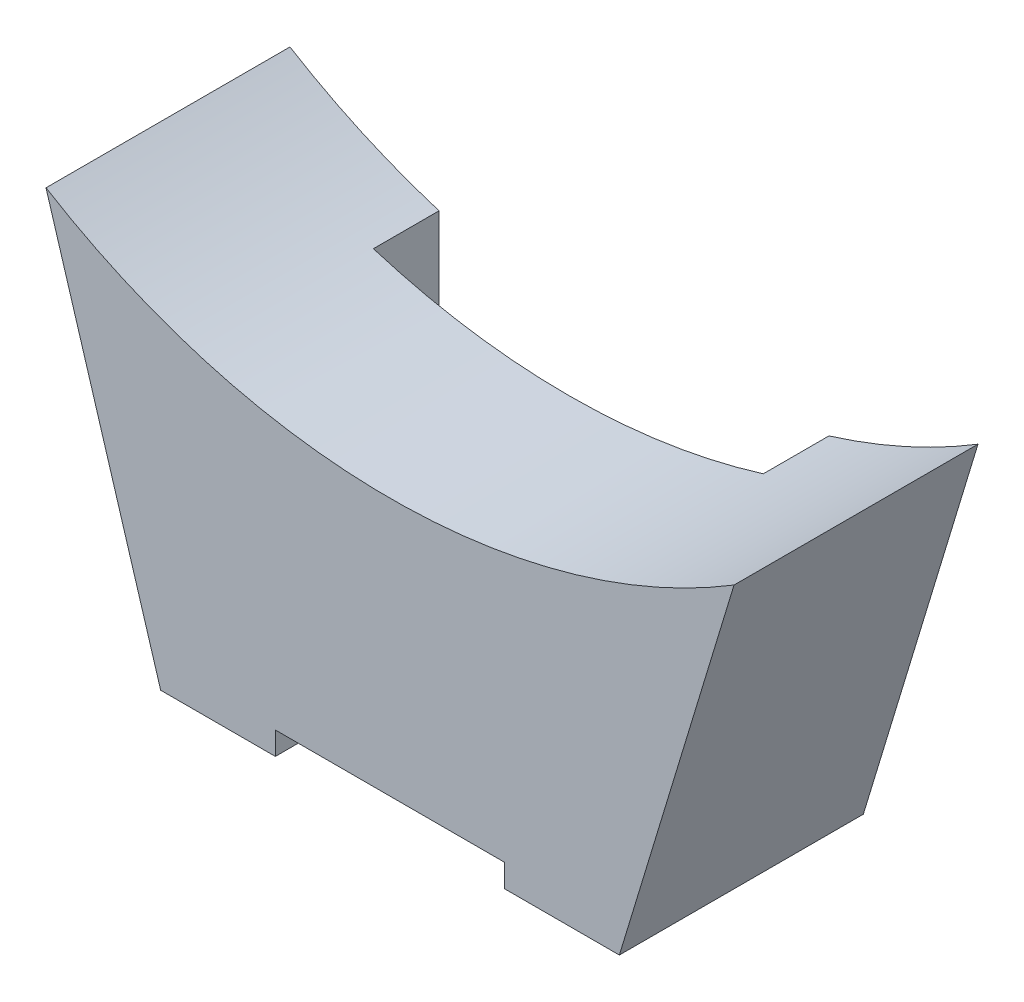
ISO-10303-21;
HEADER;
FILE_DESCRIPTION(('STEP AP214'),'2;1');
FILE_NAME('part.step','',(''),(''),'','','');
FILE_SCHEMA(('AUTOMOTIVE_DESIGN { 1 0 10303 214 1 1 1 1 }'));
ENDSEC;
DATA;
#1=APPLICATION_CONTEXT('core data for automotive mechanical design processes');
#2=APPLICATION_PROTOCOL_DEFINITION('international standard','automotive_design',2000,#1);
#3=PRODUCT_CONTEXT('',#1,'mechanical');
#4=PRODUCT('Part','Part','',(#3));
#5=PRODUCT_RELATED_PRODUCT_CATEGORY('part','',(#4));
#6=PRODUCT_DEFINITION_FORMATION('','',#4);
#7=PRODUCT_DEFINITION_CONTEXT('part definition',#1,'design');
#8=PRODUCT_DEFINITION('design','',#6,#7);
#9=PRODUCT_DEFINITION_SHAPE('','',#8);
#10=(LENGTH_UNIT() NAMED_UNIT(*) SI_UNIT(.MILLI.,.METRE.));
#11=(NAMED_UNIT(*) PLANE_ANGLE_UNIT() SI_UNIT($,.RADIAN.));
#12=(NAMED_UNIT(*) SI_UNIT($,.STERADIAN.) SOLID_ANGLE_UNIT());
#13=UNCERTAINTY_MEASURE_WITH_UNIT(LENGTH_MEASURE(1.E-05),#10,'distance_accuracy_value','');
#14=(GEOMETRIC_REPRESENTATION_CONTEXT(3) GLOBAL_UNCERTAINTY_ASSIGNED_CONTEXT((#13)) GLOBAL_UNIT_ASSIGNED_CONTEXT((#10,
#11,#12)) REPRESENTATION_CONTEXT('',''));
#15=CARTESIAN_POINT('',(0.,0.,0.));
#16=DIRECTION('',(0.,0.,1.));
#17=DIRECTION('',(1.,0.,0.));
#18=AXIS2_PLACEMENT_3D('',#15,#16,#17);
#19=CARTESIAN_POINT('',(0.,0.,0.));
#20=DIRECTION('',(0.,0.,-1.));
#21=DIRECTION('',(-1.,0.,0.));
#22=AXIS2_PLACEMENT_3D('',#19,#20,#21);
#23=PLANE('',#22);
#24=DIRECTION('',(0.,-1.,0.));
#25=VECTOR('',#24,1.);
#26=CARTESIAN_POINT('',(17.,-60.,0.));
#27=LINE('',#26,#25);
#28=CARTESIAN_POINT('',(17.,-54.9295002708017,0.));
#29=VERTEX_POINT('',#28);
#30=CARTESIAN_POINT('',(17.,-71.5,0.));
#31=VERTEX_POINT('',#30);
#32=EDGE_CURVE('E377',#29,#31,#27,.T.);
#33=ORIENTED_EDGE('',*,*,#32,.F.);
#34=CARTESIAN_POINT('',(0.,0.,0.));
#35=DIRECTION('',(0.,0.,-1.));
#36=DIRECTION('',(-1.,0.,0.));
#37=AXIS2_PLACEMENT_3D('',#34,#35,#36);
#38=CIRCLE('',#37,57.5);
#39=CARTESIAN_POINT('',(30.,-49.0535421758715,0.));
#40=VERTEX_POINT('',#39);
#41=EDGE_CURVE('E400',#40,#29,#38,.T.);
#42=ORIENTED_EDGE('',*,*,#41,.F.);
#43=DIRECTION('',(0.290438967331062,0.956893518765629,0.));
#44=VECTOR('',#43,1.);
#45=CARTESIAN_POINT('',(20.,-82.,0.));
#46=LINE('',#45,#44);
#47=CARTESIAN_POINT('',(20.,-82.,0.));
#48=VERTEX_POINT('',#47);
#49=EDGE_CURVE('E414',#48,#40,#46,.T.);
#50=ORIENTED_EDGE('',*,*,#49,.F.);
#51=DIRECTION('',(1.,0.,0.));
#52=VECTOR('',#51,1.);
#53=CARTESIAN_POINT('',(18.,-82.,0.));
#54=LINE('',#53,#52);
#55=CARTESIAN_POINT('',(18.,-82.,0.));
#56=VERTEX_POINT('',#55);
#57=EDGE_CURVE('E409',#56,#48,#54,.T.);
#58=ORIENTED_EDGE('',*,*,#57,.F.);
#59=DIRECTION('',(0.,-1.,0.));
#60=VECTOR('',#59,1.);
#61=CARTESIAN_POINT('',(18.,-60.,0.));
#62=LINE('',#61,#60);
#63=CARTESIAN_POINT('',(18.,-80.,0.));
#64=VERTEX_POINT('',#63);
#65=EDGE_CURVE('E410',#64,#56,#62,.T.);
#66=ORIENTED_EDGE('',*,*,#65,.F.);
#67=DIRECTION('',(1.,0.,0.));
#68=VECTOR('',#67,1.);
#69=CARTESIAN_POINT('',(15.6,-80.,0.));
#70=LINE('',#69,#68);
#71=CARTESIAN_POINT('',(15.6,-80.,0.));
#72=VERTEX_POINT('',#71);
#73=EDGE_CURVE('E285',#72,#64,#70,.T.);
#74=ORIENTED_EDGE('',*,*,#73,.F.);
#75=DIRECTION('',(0.,-1.,0.));
#76=VECTOR('',#75,1.);
#77=CARTESIAN_POINT('',(15.6,-76.5,0.));
#78=LINE('',#77,#76);
#79=CARTESIAN_POINT('',(15.6,-71.5,0.));
#80=VERTEX_POINT('',#79);
#81=EDGE_CURVE('E287',#80,#72,#78,.T.);
#82=ORIENTED_EDGE('',*,*,#81,.F.);
#83=DIRECTION('',(1.,0.,0.));
#84=VECTOR('',#83,1.);
#85=CARTESIAN_POINT('',(-17.,-71.5,0.));
#86=LINE('',#85,#84);
#87=EDGE_CURVE('E389',#80,#31,#86,.T.);
#88=ORIENTED_EDGE('',*,*,#87,.T.);
#89=EDGE_LOOP('',(#33,#42,#50,#58,#66,#74,#82,#88));
#90=FACE_BOUND('',#89,.T.);
#91=ADVANCED_FACE('F32',(#90),#23,.T.);
#92=CARTESIAN_POINT('',(8.8,-76.5,62.9963595499958));
#93=DIRECTION('',(0.,1.,0.));
#94=DIRECTION('',(0.,0.,1.));
#95=AXIS2_PLACEMENT_3D('',#92,#93,#94);
#96=PLANE('',#95);
#97=DIRECTION('',(1.,0.,0.));
#98=VECTOR('',#97,1.);
#99=CARTESIAN_POINT('',(-15.6,-76.5,7.77499999999998));
#100=LINE('',#99,#98);
#101=CARTESIAN_POINT('',(8.8,-76.5,7.77499999999998));
#102=VERTEX_POINT('',#101);
#103=CARTESIAN_POINT('',(15.6,-76.5,7.77499999999998));
#104=VERTEX_POINT('',#103);
#105=EDGE_CURVE('E372',#102,#104,#100,.T.);
#106=ORIENTED_EDGE('',*,*,#105,.T.);
#107=DIRECTION('',(0.,0.,-1.));
#108=VECTOR('',#107,1.);
#109=CARTESIAN_POINT('',(15.6,-76.5,62.9963595499958));
#110=LINE('',#109,#108);
#111=CARTESIAN_POINT('',(15.6,-76.5,18.275));
#112=VERTEX_POINT('',#111);
#113=EDGE_CURVE('E272',#112,#104,#110,.T.);
#114=ORIENTED_EDGE('',*,*,#113,.F.);
#115=DIRECTION('',(-1.,0.,0.));
#116=VECTOR('',#115,1.);
#117=CARTESIAN_POINT('',(8.8,-76.5,18.275));
#118=LINE('',#117,#116);
#119=CARTESIAN_POINT('',(8.8,-76.5,18.275));
#120=VERTEX_POINT('',#119);
#121=EDGE_CURVE('E309',#112,#120,#118,.T.);
#122=ORIENTED_EDGE('',*,*,#121,.T.);
#123=DIRECTION('',(0.,0.,-1.));
#124=VECTOR('',#123,1.);
#125=CARTESIAN_POINT('',(8.8,-76.5,62.9963595499958));
#126=LINE('',#125,#124);
#127=EDGE_CURVE('E269',#120,#102,#126,.T.);
#128=ORIENTED_EDGE('',*,*,#127,.T.);
#129=EDGE_LOOP('',(#106,#114,#122,#128));
#130=FACE_BOUND('',#129,.T.);
#131=ADVANCED_FACE('F536',(#130),#96,.F.);
#132=CARTESIAN_POINT('',(8.79999999999999,-71.5,62.9963595499958));
#133=DIRECTION('',(1.,0.,0.));
#134=DIRECTION('',(0.,1.,0.));
#135=AXIS2_PLACEMENT_3D('',#132,#133,#134);
#136=PLANE('',#135);
#137=DIRECTION('',(0.,1.,0.));
#138=VECTOR('',#137,1.);
#139=CARTESIAN_POINT('',(8.79999999999999,-71.5,7.77499999999998));
#140=LINE('',#139,#138);
#141=CARTESIAN_POINT('',(8.79999999999999,-71.5,7.77499999999998));
#142=VERTEX_POINT('',#141);
#143=EDGE_CURVE('E350',#102,#142,#140,.T.);
#144=ORIENTED_EDGE('',*,*,#143,.F.);
#145=ORIENTED_EDGE('',*,*,#127,.F.);
#146=DIRECTION('',(0.,1.,0.));
#147=VECTOR('',#146,1.);
#148=CARTESIAN_POINT('',(8.79999999999999,-71.5,18.275));
#149=LINE('',#148,#147);
#150=CARTESIAN_POINT('',(8.79999999999999,-71.5,18.275));
#151=VERTEX_POINT('',#150);
#152=EDGE_CURVE('E306',#120,#151,#149,.T.);
#153=ORIENTED_EDGE('',*,*,#152,.T.);
#154=DIRECTION('',(0.,0.,-1.));
#155=VECTOR('',#154,1.);
#156=CARTESIAN_POINT('',(8.79999999999999,-71.5,62.9963595499958));
#157=LINE('',#156,#155);
#158=EDGE_CURVE('E266',#151,#142,#157,.T.);
#159=ORIENTED_EDGE('',*,*,#158,.T.);
#160=EDGE_LOOP('',(#144,#145,#153,#159));
#161=FACE_BOUND('',#160,.T.);
#162=ADVANCED_FACE('F539',(#161),#136,.F.);
#163=CARTESIAN_POINT('',(-8.79999999999999,-71.5,62.9963595499958));
#164=DIRECTION('',(-1.,0.,0.));
#165=DIRECTION('',(0.,-1.,0.));
#166=AXIS2_PLACEMENT_3D('',#163,#164,#165);
#167=PLANE('',#166);
#168=DIRECTION('',(0.,-1.,0.));
#169=VECTOR('',#168,1.);
#170=CARTESIAN_POINT('',(-8.79999999999999,-71.5,7.77499999999998));
#171=LINE('',#170,#169);
#172=CARTESIAN_POINT('',(-8.79999999999999,-71.5,7.77499999999998));
#173=VERTEX_POINT('',#172);
#174=CARTESIAN_POINT('',(-8.79999999999999,-76.5,7.77499999999998));
#175=VERTEX_POINT('',#174);
#176=EDGE_CURVE('E352',#173,#175,#171,.T.);
#177=ORIENTED_EDGE('',*,*,#176,.F.);
#178=DIRECTION('',(0.,0.,-1.));
#179=VECTOR('',#178,1.);
#180=CARTESIAN_POINT('',(-8.79999999999999,-71.5,62.9963595499958));
#181=LINE('',#180,#179);
#182=CARTESIAN_POINT('',(-8.79999999999999,-71.5,18.275));
#183=VERTEX_POINT('',#182);
#184=EDGE_CURVE('E263',#183,#173,#181,.T.);
#185=ORIENTED_EDGE('',*,*,#184,.F.);
#186=DIRECTION('',(0.,-1.,0.));
#187=VECTOR('',#186,1.);
#188=CARTESIAN_POINT('',(-8.79999999999999,-71.5,18.275));
#189=LINE('',#188,#187);
#190=CARTESIAN_POINT('',(-8.79999999999999,-76.5,18.275));
#191=VERTEX_POINT('',#190);
#192=EDGE_CURVE('E300',#183,#191,#189,.T.);
#193=ORIENTED_EDGE('',*,*,#192,.T.);
#194=DIRECTION('',(0.,0.,-1.));
#195=VECTOR('',#194,1.);
#196=CARTESIAN_POINT('',(-8.79999999999999,-76.5,62.9963595499958));
#197=LINE('',#196,#195);
#198=EDGE_CURVE('E260',#191,#175,#197,.T.);
#199=ORIENTED_EDGE('',*,*,#198,.T.);
#200=EDGE_LOOP('',(#177,#185,#193,#199));
#201=FACE_BOUND('',#200,.T.);
#202=ADVANCED_FACE('F545',(#201),#167,.F.);
#203=CARTESIAN_POINT('',(-8.79999999999999,-76.5,62.9963595499958));
#204=DIRECTION('',(0.,1.,0.));
#205=DIRECTION('',(0.,0.,1.));
#206=AXIS2_PLACEMENT_3D('',#203,#204,#205);
#207=PLANE('',#206);
#208=CARTESIAN_POINT('',(-15.6,-76.5,7.77499999999998));
#209=VERTEX_POINT('',#208);
#210=EDGE_CURVE('E369',#209,#175,#100,.T.);
#211=ORIENTED_EDGE('',*,*,#210,.T.);
#212=ORIENTED_EDGE('',*,*,#198,.F.);
#213=DIRECTION('',(-1.,0.,0.));
#214=VECTOR('',#213,1.);
#215=CARTESIAN_POINT('',(-8.79999999999999,-76.5,18.275));
#216=LINE('',#215,#214);
#217=CARTESIAN_POINT('',(-15.6,-76.5,18.275));
#218=VERTEX_POINT('',#217);
#219=EDGE_CURVE('E297',#191,#218,#216,.T.);
#220=ORIENTED_EDGE('',*,*,#219,.T.);
#221=DIRECTION('',(0.,0.,-1.));
#222=VECTOR('',#221,1.);
#223=CARTESIAN_POINT('',(-15.6,-76.5,62.9963595499958));
#224=LINE('',#223,#222);
#225=EDGE_CURVE('E256',#218,#209,#224,.T.);
#226=ORIENTED_EDGE('',*,*,#225,.T.);
#227=EDGE_LOOP('',(#211,#212,#220,#226));
#228=FACE_BOUND('',#227,.T.);
#229=ADVANCED_FACE('F550',(#228),#207,.F.);
#230=CARTESIAN_POINT('',(-20.,-82.,21.275));
#231=DIRECTION('',(0.,1.,0.));
#232=DIRECTION('',(0.,0.,1.));
#233=AXIS2_PLACEMENT_3D('',#230,#231,#232);
#234=PLANE('',#233);
#235=DIRECTION('',(0.,0.,1.));
#236=VECTOR('',#235,1.);
#237=CARTESIAN_POINT('',(-10.,-82.,0.));
#238=LINE('',#237,#236);
#239=CARTESIAN_POINT('',(-10.,-82.,16.275));
#240=VERTEX_POINT('',#239);
#241=CARTESIAN_POINT('',(-10.,-82.,21.275));
#242=VERTEX_POINT('',#241);
#243=EDGE_CURVE('E331',#240,#242,#238,.T.);
#244=ORIENTED_EDGE('',*,*,#243,.T.);
#245=DIRECTION('',(1.,0.,0.));
#246=VECTOR('',#245,1.);
#247=CARTESIAN_POINT('',(-20.,-82.,21.275));
#248=LINE('',#247,#246);
#249=CARTESIAN_POINT('',(-20.,-82.,21.275));
#250=VERTEX_POINT('',#249);
#251=EDGE_CURVE('E317',#250,#242,#248,.T.);
#252=ORIENTED_EDGE('',*,*,#251,.F.);
#253=DIRECTION('',(0.,0.,-1.));
#254=VECTOR('',#253,1.);
#255=CARTESIAN_POINT('',(-20.,-82.,21.275));
#256=LINE('',#255,#254);
#257=CARTESIAN_POINT('',(-20.,-82.,0.));
#258=VERTEX_POINT('',#257);
#259=EDGE_CURVE('E293',#250,#258,#256,.T.);
#260=ORIENTED_EDGE('',*,*,#259,.T.);
#261=DIRECTION('',(1.,0.,0.));
#262=VECTOR('',#261,1.);
#263=CARTESIAN_POINT('',(-18.,-82.,0.));
#264=LINE('',#263,#262);
#265=CARTESIAN_POINT('',(-18.,-82.,0.));
#266=VERTEX_POINT('',#265);
#267=EDGE_CURVE('E405',#258,#266,#264,.T.);
#268=ORIENTED_EDGE('',*,*,#267,.T.);
#269=DIRECTION('',(0.,0.,1.));
#270=VECTOR('',#269,1.);
#271=CARTESIAN_POINT('',(-18.,-82.,-68.4504863617278));
#272=LINE('',#271,#270);
#273=CARTESIAN_POINT('',(-18.,-82.,16.275));
#274=VERTEX_POINT('',#273);
#275=EDGE_CURVE('E401',#266,#274,#272,.T.);
#276=ORIENTED_EDGE('',*,*,#275,.T.);
#277=DIRECTION('',(-1.,0.,0.));
#278=VECTOR('',#277,1.);
#279=CARTESIAN_POINT('',(-20.,-82.,16.275));
#280=LINE('',#279,#278);
#281=EDGE_CURVE('E55',#240,#274,#280,.T.);
#282=ORIENTED_EDGE('',*,*,#281,.F.);
#283=EDGE_LOOP('',(#244,#252,#260,#268,#276,#282));
#284=FACE_BOUND('',#283,.T.);
#285=ADVANCED_FACE('F459',(#284),#234,.F.);
#286=CARTESIAN_POINT('',(-20.,-80.,16.275));
#287=DIRECTION('',(0.,-1.,0.));
#288=DIRECTION('',(0.,0.,-1.));
#289=AXIS2_PLACEMENT_3D('',#286,#287,#288);
#290=PLANE('',#289);
#291=DIRECTION('',(1.,0.,0.));
#292=VECTOR('',#291,1.);
#293=CARTESIAN_POINT('',(0.,-80.,18.275));
#294=LINE('',#293,#292);
#295=CARTESIAN_POINT('',(-15.6,-80.,18.275));
#296=VERTEX_POINT('',#295);
#297=CARTESIAN_POINT('',(-10.,-80.,18.275));
#298=VERTEX_POINT('',#297);
#299=EDGE_CURVE('E252',#296,#298,#294,.T.);
#300=ORIENTED_EDGE('',*,*,#299,.T.);
#301=DIRECTION('',(0.,0.,1.));
#302=VECTOR('',#301,1.);
#303=CARTESIAN_POINT('',(-10.,-80.,0.));
#304=LINE('',#303,#302);
#305=CARTESIAN_POINT('',(-10.,-80.,16.275));
#306=VERTEX_POINT('',#305);
#307=EDGE_CURVE('E330',#306,#298,#304,.T.);
#308=ORIENTED_EDGE('',*,*,#307,.F.);
#309=DIRECTION('',(1.,0.,0.));
#310=VECTOR('',#309,1.);
#311=CARTESIAN_POINT('',(-20.,-80.,16.275));
#312=LINE('',#311,#310);
#313=CARTESIAN_POINT('',(-15.6,-80.,16.275));
#314=VERTEX_POINT('',#313);
#315=EDGE_CURVE('E324',#314,#306,#312,.T.);
#316=ORIENTED_EDGE('',*,*,#315,.F.);
#317=DIRECTION('',(0.,0.,-1.));
#318=VECTOR('',#317,1.);
#319=CARTESIAN_POINT('',(-15.6,-80.,62.9963595499958));
#320=LINE('',#319,#318);
#321=EDGE_CURVE('E279',#296,#314,#320,.T.);
#322=ORIENTED_EDGE('',*,*,#321,.F.);
#323=EDGE_LOOP('',(#300,#308,#316,#322));
#324=FACE_BOUND('',#323,.T.);
#325=ADVANCED_FACE('F479',(#324),#290,.F.);
#326=CARTESIAN_POINT('',(0.,0.,16.275));
#327=DIRECTION('',(0.,0.,1.));
#328=DIRECTION('',(1.,0.,0.));
#329=AXIS2_PLACEMENT_3D('',#326,#327,#328);
#330=PLANE('',#329);
#331=ORIENTED_EDGE('',*,*,#281,.T.);
#332=DIRECTION('',(0.,1.,0.));
#333=VECTOR('',#332,1.);
#334=CARTESIAN_POINT('',(-18.,0.,16.275));
#335=LINE('',#334,#333);
#336=CARTESIAN_POINT('',(-18.,-80.,16.275));
#337=VERTEX_POINT('',#336);
#338=EDGE_CURVE('E392',#274,#337,#335,.T.);
#339=ORIENTED_EDGE('',*,*,#338,.T.);
#340=EDGE_CURVE('E322',#337,#314,#312,.T.);
#341=ORIENTED_EDGE('',*,*,#340,.T.);
#342=ORIENTED_EDGE('',*,*,#315,.T.);
#343=DIRECTION('',(0.,-1.,0.));
#344=VECTOR('',#343,1.);
#345=CARTESIAN_POINT('',(-10.,0.,16.275));
#346=LINE('',#345,#344);
#347=EDGE_CURVE('E247',#306,#240,#346,.T.);
#348=ORIENTED_EDGE('',*,*,#347,.T.);
#349=EDGE_LOOP('',(#331,#339,#341,#342,#348));
#350=FACE_BOUND('',#349,.T.);
#351=ADVANCED_FACE('F466',(#350),#330,.F.);
#352=CARTESIAN_POINT('',(-15.6,-80.,62.9963595499958));
#353=DIRECTION('',(0.,1.,0.));
#354=DIRECTION('',(0.,0.,1.));
#355=AXIS2_PLACEMENT_3D('',#352,#353,#354);
#356=PLANE('',#355);
#357=ORIENTED_EDGE('',*,*,#340,.F.);
#358=DIRECTION('',(0.,0.,-1.));
#359=VECTOR('',#358,1.);
#360=CARTESIAN_POINT('',(-18.,-80.,62.9963595499958));
#361=LINE('',#360,#359);
#362=CARTESIAN_POINT('',(-18.,-80.,0.));
#363=VERTEX_POINT('',#362);
#364=EDGE_CURVE('E394',#337,#363,#361,.T.);
#365=ORIENTED_EDGE('',*,*,#364,.T.);
#366=DIRECTION('',(1.,0.,0.));
#367=VECTOR('',#366,1.);
#368=CARTESIAN_POINT('',(-15.6,-80.,0.));
#369=LINE('',#368,#367);
#370=CARTESIAN_POINT('',(-15.6,-80.,0.));
#371=VERTEX_POINT('',#370);
#372=EDGE_CURVE('E283',#363,#371,#369,.T.);
#373=ORIENTED_EDGE('',*,*,#372,.T.);
#374=EDGE_CURVE('E282',#314,#371,#320,.T.);
#375=ORIENTED_EDGE('',*,*,#374,.F.);
#376=EDGE_LOOP('',(#357,#365,#373,#375));
#377=FACE_BOUND('',#376,.T.);
#378=ADVANCED_FACE('F471',(#377),#356,.F.);
#379=CARTESIAN_POINT('',(15.6,-80.,62.9963595499958));
#380=DIRECTION('',(0.,1.,0.));
#381=DIRECTION('',(0.,0.,1.));
#382=AXIS2_PLACEMENT_3D('',#379,#380,#381);
#383=PLANE('',#382);
#384=ORIENTED_EDGE('',*,*,#73,.T.);
#385=DIRECTION('',(0.,0.,1.));
#386=VECTOR('',#385,1.);
#387=CARTESIAN_POINT('',(18.,-80.,62.9963595499958));
#388=LINE('',#387,#386);
#389=CARTESIAN_POINT('',(18.,-80.,16.275));
#390=VERTEX_POINT('',#389);
#391=EDGE_CURVE('E396',#64,#390,#388,.T.);
#392=ORIENTED_EDGE('',*,*,#391,.T.);
#393=CARTESIAN_POINT('',(15.6,-80.,16.275));
#394=VERTEX_POINT('',#393);
#395=EDGE_CURVE('E329',#394,#390,#312,.T.);
#396=ORIENTED_EDGE('',*,*,#395,.F.);
#397=DIRECTION('',(0.,0.,-1.));
#398=VECTOR('',#397,1.);
#399=CARTESIAN_POINT('',(15.6,-80.,62.9963595499958));
#400=LINE('',#399,#398);
#401=EDGE_CURVE('E278',#394,#72,#400,.T.);
#402=ORIENTED_EDGE('',*,*,#401,.T.);
#403=EDGE_LOOP('',(#384,#392,#396,#402));
#404=FACE_BOUND('',#403,.T.);
#405=ADVANCED_FACE('F563',(#404),#383,.F.);
#406=CARTESIAN_POINT('',(0.,0.,18.275));
#407=DIRECTION('',(0.,0.,1.));
#408=DIRECTION('',(1.,0.,0.));
#409=AXIS2_PLACEMENT_3D('',#406,#407,#408);
#410=PLANE('',#409);
#411=ORIENTED_EDGE('',*,*,#299,.F.);
#412=DIRECTION('',(0.,-1.,0.));
#413=VECTOR('',#412,1.);
#414=CARTESIAN_POINT('',(-15.6,-76.5,18.275));
#415=LINE('',#414,#413);
#416=EDGE_CURVE('E294',#218,#296,#415,.T.);
#417=ORIENTED_EDGE('',*,*,#416,.F.);
#418=ORIENTED_EDGE('',*,*,#219,.F.);
#419=ORIENTED_EDGE('',*,*,#192,.F.);
#420=DIRECTION('',(-1.,0.,0.));
#421=VECTOR('',#420,1.);
#422=CARTESIAN_POINT('',(8.79999999999999,-71.5,18.275));
#423=LINE('',#422,#421);
#424=EDGE_CURVE('E303',#151,#183,#423,.T.);
#425=ORIENTED_EDGE('',*,*,#424,.F.);
#426=ORIENTED_EDGE('',*,*,#152,.F.);
#427=ORIENTED_EDGE('',*,*,#121,.F.);
#428=DIRECTION('',(0.,1.,0.));
#429=VECTOR('',#428,1.);
#430=CARTESIAN_POINT('',(15.6,-76.5,18.275));
#431=LINE('',#430,#429);
#432=CARTESIAN_POINT('',(15.6,-80.,18.275));
#433=VERTEX_POINT('',#432);
#434=EDGE_CURVE('E259',#433,#112,#431,.T.);
#435=ORIENTED_EDGE('',*,*,#434,.F.);
#436=CARTESIAN_POINT('',(10.,-80.,18.275));
#437=VERTEX_POINT('',#436);
#438=EDGE_CURVE('E255',#437,#433,#294,.T.);
#439=ORIENTED_EDGE('',*,*,#438,.F.);
#440=DIRECTION('',(-1.,0.,0.));
#441=VECTOR('',#440,1.);
#442=CARTESIAN_POINT('',(0.,-80.,18.275));
#443=LINE('',#442,#441);
#444=EDGE_CURVE('E326',#437,#298,#443,.T.);
#445=ORIENTED_EDGE('',*,*,#444,.T.);
#446=EDGE_LOOP('',(#411,#417,#418,#419,#425,#426,#427,#435,#439,#445));
#447=FACE_BOUND('',#446,.T.);
#448=ADVANCED_FACE('F482',(#447),#410,.F.);
#449=CARTESIAN_POINT('',(-17.,-54.9295002708017,0.));
#450=VERTEX_POINT('',#449);
#451=CARTESIAN_POINT('',(-30.,-49.0535421758715,0.));
#452=VERTEX_POINT('',#451);
#453=EDGE_CURVE('E413',#450,#452,#38,.T.);
#454=ORIENTED_EDGE('',*,*,#453,.F.);
#455=DIRECTION('',(0.,-1.,0.));
#456=VECTOR('',#455,1.);
#457=CARTESIAN_POINT('',(-17.,-60.,0.));
#458=LINE('',#457,#456);
#459=CARTESIAN_POINT('',(-17.,-71.5,0.));
#460=VERTEX_POINT('',#459);
#461=EDGE_CURVE('E47',#450,#460,#458,.T.);
#462=ORIENTED_EDGE('',*,*,#461,.T.);
#463=CARTESIAN_POINT('',(-15.6,-71.5,0.));
#464=VERTEX_POINT('',#463);
#465=EDGE_CURVE('E386',#460,#464,#86,.T.);
#466=ORIENTED_EDGE('',*,*,#465,.T.);
#467=DIRECTION('',(0.,1.,0.));
#468=VECTOR('',#467,1.);
#469=CARTESIAN_POINT('',(-15.6,-76.5,0.));
#470=LINE('',#469,#468);
#471=EDGE_CURVE('E290',#371,#464,#470,.T.);
#472=ORIENTED_EDGE('',*,*,#471,.F.);
#473=ORIENTED_EDGE('',*,*,#372,.F.);
#474=DIRECTION('',(0.,1.,0.));
#475=VECTOR('',#474,1.);
#476=CARTESIAN_POINT('',(-18.,-60.,0.));
#477=LINE('',#476,#475);
#478=EDGE_CURVE('E404',#266,#363,#477,.T.);
#479=ORIENTED_EDGE('',*,*,#478,.F.);
#480=ORIENTED_EDGE('',*,*,#267,.F.);
#481=DIRECTION('',(0.290438967331062,-0.956893518765628,0.));
#482=VECTOR('',#481,1.);
#483=CARTESIAN_POINT('',(-30.,-49.0535421758715,0.));
#484=LINE('',#483,#482);
#485=EDGE_CURVE('E417',#452,#258,#484,.T.);
#486=ORIENTED_EDGE('',*,*,#485,.F.);
#487=EDGE_LOOP('',(#454,#462,#466,#472,#473,#479,#480,#486));
#488=FACE_BOUND('',#487,.T.);
#489=ADVANCED_FACE('F555',(#488),#23,.T.);
#490=CARTESIAN_POINT('',(15.6,-76.5,62.9963595499958));
#491=DIRECTION('',(1.,0.,0.));
#492=DIRECTION('',(0.,0.,-1.));
#493=AXIS2_PLACEMENT_3D('',#490,#491,#492);
#494=PLANE('',#493);
#495=EDGE_CURVE('E275',#433,#394,#400,.T.);
#496=ORIENTED_EDGE('',*,*,#495,.F.);
#497=ORIENTED_EDGE('',*,*,#434,.T.);
#498=ORIENTED_EDGE('',*,*,#113,.T.);
#499=DIRECTION('',(0.,1.,0.));
#500=VECTOR('',#499,1.);
#501=CARTESIAN_POINT('',(15.6,-76.5,7.77499999999998));
#502=LINE('',#501,#500);
#503=CARTESIAN_POINT('',(15.6,-71.5,7.77499999999998));
#504=VERTEX_POINT('',#503);
#505=EDGE_CURVE('E365',#104,#504,#502,.T.);
#506=ORIENTED_EDGE('',*,*,#505,.T.);
#507=DIRECTION('',(0.,0.,-1.));
#508=VECTOR('',#507,1.);
#509=CARTESIAN_POINT('',(15.6,-71.5,39.3731012087752));
#510=LINE('',#509,#508);
#511=CARTESIAN_POINT('',(15.6,-71.5,5.725));
#512=VERTEX_POINT('',#511);
#513=EDGE_CURVE('E361',#504,#512,#510,.T.);
#514=ORIENTED_EDGE('',*,*,#513,.T.);
#515=DIRECTION('',(0.,0.,-1.));
#516=VECTOR('',#515,1.);
#517=CARTESIAN_POINT('',(15.6,-71.5,62.9963595499958));
#518=LINE('',#517,#516);
#519=EDGE_CURVE('E234',#512,#80,#518,.T.);
#520=ORIENTED_EDGE('',*,*,#519,.T.);
#521=ORIENTED_EDGE('',*,*,#81,.T.);
#522=ORIENTED_EDGE('',*,*,#401,.F.);
#523=EDGE_LOOP('',(#496,#497,#498,#506,#514,#520,#521,#522));
#524=FACE_BOUND('',#523,.T.);
#525=ADVANCED_FACE('F529',(#524),#494,.F.);
#526=CARTESIAN_POINT('',(8.79999999999999,-71.5,62.9963595499958));
#527=DIRECTION('',(0.,1.,0.));
#528=DIRECTION('',(0.,0.,1.));
#529=AXIS2_PLACEMENT_3D('',#526,#527,#528);
#530=PLANE('',#529);
#531=DIRECTION('',(0.,0.,-1.));
#532=VECTOR('',#531,1.);
#533=CARTESIAN_POINT('',(-15.6,-71.5,39.3731012087752));
#534=LINE('',#533,#532);
#535=CARTESIAN_POINT('',(-15.6,-71.5,7.77499999999998));
#536=VERTEX_POINT('',#535);
#537=CARTESIAN_POINT('',(-15.6,-71.5,5.72499999999999));
#538=VERTEX_POINT('',#537);
#539=EDGE_CURVE('E358',#536,#538,#534,.T.);
#540=ORIENTED_EDGE('',*,*,#539,.T.);
#541=DIRECTION('',(-1.,0.,0.));
#542=VECTOR('',#541,1.);
#543=CARTESIAN_POINT('',(-17.,-71.5,5.725));
#544=LINE('',#543,#542);
#545=EDGE_CURVE('E382',#512,#538,#544,.T.);
#546=ORIENTED_EDGE('',*,*,#545,.F.);
#547=ORIENTED_EDGE('',*,*,#513,.F.);
#548=DIRECTION('',(-1.,0.,0.));
#549=VECTOR('',#548,1.);
#550=CARTESIAN_POINT('',(-15.6,-71.5,7.77499999999998));
#551=LINE('',#550,#549);
#552=EDGE_CURVE('E354',#504,#142,#551,.T.);
#553=ORIENTED_EDGE('',*,*,#552,.T.);
#554=ORIENTED_EDGE('',*,*,#158,.F.);
#555=ORIENTED_EDGE('',*,*,#424,.T.);
#556=ORIENTED_EDGE('',*,*,#184,.T.);
#557=EDGE_CURVE('E357',#173,#536,#551,.T.);
#558=ORIENTED_EDGE('',*,*,#557,.T.);
#559=EDGE_LOOP('',(#540,#546,#547,#553,#554,#555,#556,#558));
#560=FACE_BOUND('',#559,.T.);
#561=ADVANCED_FACE('F525',(#560),#530,.F.);
#562=CARTESIAN_POINT('',(-15.6,-76.5,62.9963595499958));
#563=DIRECTION('',(-1.,0.,0.));
#564=DIRECTION('',(0.,0.,1.));
#565=AXIS2_PLACEMENT_3D('',#562,#563,#564);
#566=PLANE('',#565);
#567=ORIENTED_EDGE('',*,*,#225,.F.);
#568=ORIENTED_EDGE('',*,*,#416,.T.);
#569=ORIENTED_EDGE('',*,*,#321,.T.);
#570=ORIENTED_EDGE('',*,*,#374,.T.);
#571=ORIENTED_EDGE('',*,*,#471,.T.);
#572=EDGE_CURVE('E362',#538,#464,#534,.T.);
#573=ORIENTED_EDGE('',*,*,#572,.F.);
#574=ORIENTED_EDGE('',*,*,#539,.F.);
#575=DIRECTION('',(0.,-1.,0.));
#576=VECTOR('',#575,1.);
#577=CARTESIAN_POINT('',(-15.6,-76.5,7.77499999999998));
#578=LINE('',#577,#576);
#579=EDGE_CURVE('E366',#536,#209,#578,.T.);
#580=ORIENTED_EDGE('',*,*,#579,.T.);
#581=EDGE_LOOP('',(#567,#568,#569,#570,#571,#573,#574,#580));
#582=FACE_BOUND('',#581,.T.);
#583=ADVANCED_FACE('F34',(#582),#566,.F.);
#584=CARTESIAN_POINT('',(18.,-82.,16.275));
#585=VERTEX_POINT('',#584);
#586=CARTESIAN_POINT('',(10.,-82.,16.275));
#587=VERTEX_POINT('',#586);
#588=EDGE_CURVE('E320',#585,#587,#280,.T.);
#589=ORIENTED_EDGE('',*,*,#588,.F.);
#590=DIRECTION('',(0.,0.,1.));
#591=VECTOR('',#590,1.);
#592=CARTESIAN_POINT('',(18.,-82.,-68.4504863617278));
#593=LINE('',#592,#591);
#594=EDGE_CURVE('E406',#56,#585,#593,.T.);
#595=ORIENTED_EDGE('',*,*,#594,.F.);
#596=ORIENTED_EDGE('',*,*,#57,.T.);
#597=DIRECTION('',(0.,0.,-1.));
#598=VECTOR('',#597,1.);
#599=CARTESIAN_POINT('',(20.,-82.,21.275));
#600=LINE('',#599,#598);
#601=CARTESIAN_POINT('',(20.,-82.,21.275));
#602=VERTEX_POINT('',#601);
#603=EDGE_CURVE('E315',#602,#48,#600,.T.);
#604=ORIENTED_EDGE('',*,*,#603,.F.);
#605=CARTESIAN_POINT('',(10.,-82.,21.275));
#606=VERTEX_POINT('',#605);
#607=EDGE_CURVE('E319',#606,#602,#248,.T.);
#608=ORIENTED_EDGE('',*,*,#607,.F.);
#609=DIRECTION('',(0.,0.,1.));
#610=VECTOR('',#609,1.);
#611=CARTESIAN_POINT('',(10.,-82.,0.));
#612=LINE('',#611,#610);
#613=EDGE_CURVE('E334',#587,#606,#612,.T.);
#614=ORIENTED_EDGE('',*,*,#613,.F.);
#615=EDGE_LOOP('',(#589,#595,#596,#604,#608,#614));
#616=FACE_BOUND('',#615,.T.);
#617=ADVANCED_FACE('F511',(#616),#234,.F.);
#618=CARTESIAN_POINT('',(0.,0.,21.275));
#619=DIRECTION('',(0.,0.,1.));
#620=DIRECTION('',(1.,0.,0.));
#621=AXIS2_PLACEMENT_3D('',#618,#619,#620);
#622=PLANE('',#621);
#623=DIRECTION('',(0.290438967331062,-0.956893518765629,0.));
#624=VECTOR('',#623,1.);
#625=CARTESIAN_POINT('',(-30.,-49.0535421758715,21.275));
#626=LINE('',#625,#624);
#627=CARTESIAN_POINT('',(-30.,-49.0535421758715,21.275));
#628=VERTEX_POINT('',#627);
#629=EDGE_CURVE('E432',#628,#250,#626,.T.);
#630=ORIENTED_EDGE('',*,*,#629,.T.);
#631=ORIENTED_EDGE('',*,*,#251,.T.);
#632=DIRECTION('',(0.,-1.,0.));
#633=VECTOR('',#632,1.);
#634=CARTESIAN_POINT('',(-10.,-82.,21.275));
#635=LINE('',#634,#633);
#636=CARTESIAN_POINT('',(-10.,-80.,21.275));
#637=VERTEX_POINT('',#636);
#638=EDGE_CURVE('E347',#637,#242,#635,.T.);
#639=ORIENTED_EDGE('',*,*,#638,.F.);
#640=DIRECTION('',(-1.,0.,0.));
#641=VECTOR('',#640,1.);
#642=CARTESIAN_POINT('',(-10.,-80.,21.275));
#643=LINE('',#642,#641);
#644=CARTESIAN_POINT('',(10.,-80.,21.275));
#645=VERTEX_POINT('',#644);
#646=EDGE_CURVE('E335',#645,#637,#643,.T.);
#647=ORIENTED_EDGE('',*,*,#646,.F.);
#648=DIRECTION('',(0.,1.,0.));
#649=VECTOR('',#648,1.);
#650=CARTESIAN_POINT('',(10.,-82.,21.275));
#651=LINE('',#650,#649);
#652=EDGE_CURVE('E344',#606,#645,#651,.T.);
#653=ORIENTED_EDGE('',*,*,#652,.F.);
#654=ORIENTED_EDGE('',*,*,#607,.T.);
#655=DIRECTION('',(0.290438967331062,0.956893518765629,0.));
#656=VECTOR('',#655,1.);
#657=CARTESIAN_POINT('',(20.,-82.,21.275));
#658=LINE('',#657,#656);
#659=CARTESIAN_POINT('',(30.,-49.0535421758715,21.275));
#660=VERTEX_POINT('',#659);
#661=EDGE_CURVE('E428',#602,#660,#658,.T.);
#662=ORIENTED_EDGE('',*,*,#661,.T.);
#663=CARTESIAN_POINT('',(0.,0.,21.275));
#664=DIRECTION('',(0.,0.,-1.));
#665=DIRECTION('',(1.,0.,0.));
#666=AXIS2_PLACEMENT_3D('',#663,#664,#665);
#667=CIRCLE('',#666,57.5);
#668=EDGE_CURVE('E429',#660,#628,#667,.T.);
#669=ORIENTED_EDGE('',*,*,#668,.T.);
#670=EDGE_LOOP('',(#630,#631,#639,#647,#653,#654,#662,#669));
#671=FACE_BOUND('',#670,.T.);
#672=ADVANCED_FACE('F438',(#671),#622,.T.);
#673=CARTESIAN_POINT('',(10.,-80.,16.275));
#674=VERTEX_POINT('',#673);
#675=EDGE_CURVE('E325',#674,#394,#312,.T.);
#676=ORIENTED_EDGE('',*,*,#675,.F.);
#677=DIRECTION('',(0.,0.,1.));
#678=VECTOR('',#677,1.);
#679=CARTESIAN_POINT('',(10.,-80.,0.));
#680=LINE('',#679,#678);
#681=EDGE_CURVE('E339',#674,#437,#680,.T.);
#682=ORIENTED_EDGE('',*,*,#681,.T.);
#683=ORIENTED_EDGE('',*,*,#438,.T.);
#684=ORIENTED_EDGE('',*,*,#495,.T.);
#685=EDGE_LOOP('',(#676,#682,#683,#684));
#686=FACE_BOUND('',#685,.T.);
#687=ADVANCED_FACE('F494',(#686),#290,.F.);
#688=ORIENTED_EDGE('',*,*,#395,.T.);
#689=DIRECTION('',(0.,-1.,0.));
#690=VECTOR('',#689,1.);
#691=CARTESIAN_POINT('',(18.,0.,16.275));
#692=LINE('',#691,#690);
#693=EDGE_CURVE('E241',#390,#585,#692,.T.);
#694=ORIENTED_EDGE('',*,*,#693,.T.);
#695=ORIENTED_EDGE('',*,*,#588,.T.);
#696=DIRECTION('',(0.,1.,0.));
#697=VECTOR('',#696,1.);
#698=CARTESIAN_POINT('',(10.,0.,16.275));
#699=LINE('',#698,#697);
#700=EDGE_CURVE('E249',#587,#674,#699,.T.);
#701=ORIENTED_EDGE('',*,*,#700,.T.);
#702=ORIENTED_EDGE('',*,*,#675,.T.);
#703=EDGE_LOOP('',(#688,#694,#695,#701,#702));
#704=FACE_BOUND('',#703,.T.);
#705=ADVANCED_FACE('F500',(#704),#330,.F.);
#706=CARTESIAN_POINT('',(-10.,-82.,0.));
#707=DIRECTION('',(-1.,0.,0.));
#708=DIRECTION('',(0.,0.,1.));
#709=AXIS2_PLACEMENT_3D('',#706,#707,#708);
#710=PLANE('',#709);
#711=ORIENTED_EDGE('',*,*,#307,.T.);
#712=EDGE_CURVE('E340',#298,#637,#304,.T.);
#713=ORIENTED_EDGE('',*,*,#712,.T.);
#714=ORIENTED_EDGE('',*,*,#638,.T.);
#715=ORIENTED_EDGE('',*,*,#243,.F.);
#716=ORIENTED_EDGE('',*,*,#347,.F.);
#717=EDGE_LOOP('',(#711,#713,#714,#715,#716));
#718=FACE_BOUND('',#717,.T.);
#719=ADVANCED_FACE('F458',(#718),#710,.F.);
#720=CARTESIAN_POINT('',(-10.,-80.,0.));
#721=DIRECTION('',(0.,1.,0.));
#722=DIRECTION('',(0.,0.,1.));
#723=AXIS2_PLACEMENT_3D('',#720,#721,#722);
#724=PLANE('',#723);
#725=EDGE_CURVE('E337',#437,#645,#680,.T.);
#726=ORIENTED_EDGE('',*,*,#725,.T.);
#727=ORIENTED_EDGE('',*,*,#646,.T.);
#728=ORIENTED_EDGE('',*,*,#712,.F.);
#729=ORIENTED_EDGE('',*,*,#444,.F.);
#730=EDGE_LOOP('',(#726,#727,#728,#729));
#731=FACE_BOUND('',#730,.T.);
#732=ADVANCED_FACE('F487',(#731),#724,.F.);
#733=CARTESIAN_POINT('',(10.,-82.,0.));
#734=DIRECTION('',(1.,0.,0.));
#735=DIRECTION('',(0.,0.,-1.));
#736=AXIS2_PLACEMENT_3D('',#733,#734,#735);
#737=PLANE('',#736);
#738=ORIENTED_EDGE('',*,*,#613,.T.);
#739=ORIENTED_EDGE('',*,*,#652,.T.);
#740=ORIENTED_EDGE('',*,*,#725,.F.);
#741=ORIENTED_EDGE('',*,*,#681,.F.);
#742=ORIENTED_EDGE('',*,*,#700,.F.);
#743=EDGE_LOOP('',(#738,#739,#740,#741,#742));
#744=FACE_BOUND('',#743,.T.);
#745=ADVANCED_FACE('F490',(#744),#737,.F.);
#746=CARTESIAN_POINT('',(-14.2,-72.5,7.77499999999998));
#747=DIRECTION('',(0.,0.,-1.));
#748=DIRECTION('',(0.,-1.,0.));
#749=AXIS2_PLACEMENT_3D('',#746,#747,#748);
#750=PLANE('',#749);
#751=ORIENTED_EDGE('',*,*,#176,.T.);
#752=ORIENTED_EDGE('',*,*,#210,.F.);
#753=ORIENTED_EDGE('',*,*,#579,.F.);
#754=ORIENTED_EDGE('',*,*,#557,.F.);
#755=EDGE_LOOP('',(#751,#752,#753,#754));
#756=FACE_BOUND('',#755,.T.);
#757=ADVANCED_FACE('F547',(#756),#750,.T.);
#758=ORIENTED_EDGE('',*,*,#143,.T.);
#759=ORIENTED_EDGE('',*,*,#552,.F.);
#760=ORIENTED_EDGE('',*,*,#505,.F.);
#761=ORIENTED_EDGE('',*,*,#105,.F.);
#762=EDGE_LOOP('',(#758,#759,#760,#761));
#763=FACE_BOUND('',#762,.T.);
#764=ADVANCED_FACE('F533',(#763),#750,.T.);
#765=CARTESIAN_POINT('',(0.,-71.5,0.));
#766=DIRECTION('',(0.,-1.,0.));
#767=DIRECTION('',(0.,0.,-1.));
#768=AXIS2_PLACEMENT_3D('',#765,#766,#767);
#769=PLANE('',#768);
#770=CARTESIAN_POINT('',(17.,-71.5,5.725));
#771=VERTEX_POINT('',#770);
#772=EDGE_CURVE('E378',#771,#512,#544,.T.);
#773=ORIENTED_EDGE('',*,*,#772,.F.);
#774=DIRECTION('',(0.,0.,1.));
#775=VECTOR('',#774,1.);
#776=CARTESIAN_POINT('',(17.,-71.5,5.725));
#777=LINE('',#776,#775);
#778=EDGE_CURVE('E383',#31,#771,#777,.T.);
#779=ORIENTED_EDGE('',*,*,#778,.F.);
#780=ORIENTED_EDGE('',*,*,#87,.F.);
#781=ORIENTED_EDGE('',*,*,#519,.F.);
#782=EDGE_LOOP('',(#773,#779,#780,#781));
#783=FACE_BOUND('',#782,.T.);
#784=ADVANCED_FACE('F617',(#783),#769,.F.);
#785=ORIENTED_EDGE('',*,*,#465,.F.);
#786=DIRECTION('',(0.,0.,-1.));
#787=VECTOR('',#786,1.);
#788=CARTESIAN_POINT('',(-17.,-71.5,5.725));
#789=LINE('',#788,#787);
#790=CARTESIAN_POINT('',(-17.,-71.5,5.725));
#791=VERTEX_POINT('',#790);
#792=EDGE_CURVE('E390',#791,#460,#789,.T.);
#793=ORIENTED_EDGE('',*,*,#792,.F.);
#794=EDGE_CURVE('E232',#538,#791,#544,.T.);
#795=ORIENTED_EDGE('',*,*,#794,.F.);
#796=ORIENTED_EDGE('',*,*,#572,.T.);
#797=EDGE_LOOP('',(#785,#793,#795,#796));
#798=FACE_BOUND('',#797,.T.);
#799=ADVANCED_FACE('F553',(#798),#769,.F.);
#800=CARTESIAN_POINT('',(-17.,-60.,5.725));
#801=DIRECTION('',(-1.,0.,0.));
#802=DIRECTION('',(0.,0.,1.));
#803=AXIS2_PLACEMENT_3D('',#800,#801,#802);
#804=PLANE('',#803);
#805=ORIENTED_EDGE('',*,*,#792,.T.);
#806=ORIENTED_EDGE('',*,*,#461,.F.);
#807=DIRECTION('',(0.,0.,1.));
#808=VECTOR('',#807,1.);
#809=CARTESIAN_POINT('',(-17.,-54.9295002708017,-68.4504863617278));
#810=LINE('',#809,#808);
#811=CARTESIAN_POINT('',(-17.,-54.9295002708017,5.725));
#812=VERTEX_POINT('',#811);
#813=EDGE_CURVE('E237',#450,#812,#810,.T.);
#814=ORIENTED_EDGE('',*,*,#813,.T.);
#815=DIRECTION('',(0.,-1.,0.));
#816=VECTOR('',#815,1.);
#817=CARTESIAN_POINT('',(-17.,-60.,5.725));
#818=LINE('',#817,#816);
#819=EDGE_CURVE('E226',#812,#791,#818,.T.);
#820=ORIENTED_EDGE('',*,*,#819,.T.);
#821=EDGE_LOOP('',(#805,#806,#814,#820));
#822=FACE_BOUND('',#821,.T.);
#823=ADVANCED_FACE('F238',(#822),#804,.F.);
#824=CARTESIAN_POINT('',(-17.,-60.,5.725));
#825=DIRECTION('',(0.,0.,1.));
#826=DIRECTION('',(1.,0.,0.));
#827=AXIS2_PLACEMENT_3D('',#824,#825,#826);
#828=PLANE('',#827);
#829=ORIENTED_EDGE('',*,*,#772,.T.);
#830=ORIENTED_EDGE('',*,*,#545,.T.);
#831=ORIENTED_EDGE('',*,*,#794,.T.);
#832=ORIENTED_EDGE('',*,*,#819,.F.);
#833=CARTESIAN_POINT('',(0.,0.,5.72499999999999));
#834=DIRECTION('',(0.,0.,1.));
#835=DIRECTION('',(1.,0.,0.));
#836=AXIS2_PLACEMENT_3D('',#833,#834,#835);
#837=CIRCLE('',#836,57.5);
#838=CARTESIAN_POINT('',(17.,-54.9295002708017,5.725));
#839=VERTEX_POINT('',#838);
#840=EDGE_CURVE('E40',#812,#839,#837,.T.);
#841=ORIENTED_EDGE('',*,*,#840,.T.);
#842=DIRECTION('',(0.,-1.,0.));
#843=VECTOR('',#842,1.);
#844=CARTESIAN_POINT('',(17.,-60.,5.725));
#845=LINE('',#844,#843);
#846=EDGE_CURVE('E235',#839,#771,#845,.T.);
#847=ORIENTED_EDGE('',*,*,#846,.T.);
#848=EDGE_LOOP('',(#829,#830,#831,#832,#841,#847));
#849=FACE_BOUND('',#848,.T.);
#850=ADVANCED_FACE('F228',(#849),#828,.F.);
#851=CARTESIAN_POINT('',(17.,-60.,5.725));
#852=DIRECTION('',(1.,0.,0.));
#853=DIRECTION('',(0.,0.,-1.));
#854=AXIS2_PLACEMENT_3D('',#851,#852,#853);
#855=PLANE('',#854);
#856=ORIENTED_EDGE('',*,*,#778,.T.);
#857=ORIENTED_EDGE('',*,*,#846,.F.);
#858=DIRECTION('',(0.,0.,1.));
#859=VECTOR('',#858,1.);
#860=CARTESIAN_POINT('',(17.,-54.9295002708017,-68.4504863617278));
#861=LINE('',#860,#859);
#862=EDGE_CURVE('E11',#839,#29,#861,.F.);
#863=ORIENTED_EDGE('',*,*,#862,.T.);
#864=ORIENTED_EDGE('',*,*,#32,.T.);
#865=EDGE_LOOP('',(#856,#857,#863,#864));
#866=FACE_BOUND('',#865,.T.);
#867=ADVANCED_FACE('F519',(#866),#855,.F.);
#868=CARTESIAN_POINT('',(-18.,-60.,-68.4504863617278));
#869=DIRECTION('',(1.,0.,0.));
#870=DIRECTION('',(0.,0.,-1.));
#871=AXIS2_PLACEMENT_3D('',#868,#869,#870);
#872=PLANE('',#871);
#873=ORIENTED_EDGE('',*,*,#338,.F.);
#874=ORIENTED_EDGE('',*,*,#275,.F.);
#875=ORIENTED_EDGE('',*,*,#478,.T.);
#876=ORIENTED_EDGE('',*,*,#364,.F.);
#877=EDGE_LOOP('',(#873,#874,#875,#876));
#878=FACE_BOUND('',#877,.T.);
#879=ADVANCED_FACE('F463',(#878),#872,.T.);
#880=CARTESIAN_POINT('',(18.,-60.,-68.4504863617278));
#881=DIRECTION('',(-1.,0.,0.));
#882=DIRECTION('',(0.,0.,1.));
#883=AXIS2_PLACEMENT_3D('',#880,#881,#882);
#884=PLANE('',#883);
#885=ORIENTED_EDGE('',*,*,#391,.F.);
#886=ORIENTED_EDGE('',*,*,#65,.T.);
#887=ORIENTED_EDGE('',*,*,#594,.T.);
#888=ORIENTED_EDGE('',*,*,#693,.F.);
#889=EDGE_LOOP('',(#885,#886,#887,#888));
#890=FACE_BOUND('',#889,.T.);
#891=ADVANCED_FACE('F506',(#890),#884,.T.);
#892=CARTESIAN_POINT('',(-30.,-49.0535421758715,-68.4504863617278));
#893=DIRECTION('',(-0.956893518765629,-0.290438967331062,0.));
#894=DIRECTION('',(0.290438967331062,-0.956893518765628,0.));
#895=AXIS2_PLACEMENT_3D('',#892,#893,#894);
#896=PLANE('',#895);
#897=DIRECTION('',(0.,0.,1.));
#898=VECTOR('',#897,1.);
#899=CARTESIAN_POINT('',(-30.,-49.0535421758715,-68.4504863617278));
#900=LINE('',#899,#898);
#901=EDGE_CURVE('E398',#452,#628,#900,.T.);
#902=ORIENTED_EDGE('',*,*,#901,.F.);
#903=ORIENTED_EDGE('',*,*,#485,.T.);
#904=ORIENTED_EDGE('',*,*,#259,.F.);
#905=ORIENTED_EDGE('',*,*,#629,.F.);
#906=EDGE_LOOP('',(#902,#903,#904,#905));
#907=FACE_BOUND('',#906,.T.);
#908=ADVANCED_FACE('F452',(#907),#896,.T.);
#909=CARTESIAN_POINT('',(20.,-82.,-68.4504863617278));
#910=DIRECTION('',(0.956893518765629,-0.290438967331062,0.));
#911=DIRECTION('',(0.290438967331062,0.956893518765629,0.));
#912=AXIS2_PLACEMENT_3D('',#909,#910,#911);
#913=PLANE('',#912);
#914=ORIENTED_EDGE('',*,*,#603,.T.);
#915=ORIENTED_EDGE('',*,*,#49,.T.);
#916=DIRECTION('',(0.,0.,1.));
#917=VECTOR('',#916,1.);
#918=CARTESIAN_POINT('',(30.,-49.0535421758715,-68.4504863617278));
#919=LINE('',#918,#917);
#920=EDGE_CURVE('E411',#40,#660,#919,.T.);
#921=ORIENTED_EDGE('',*,*,#920,.T.);
#922=ORIENTED_EDGE('',*,*,#661,.F.);
#923=EDGE_LOOP('',(#914,#915,#921,#922));
#924=FACE_BOUND('',#923,.T.);
#925=ADVANCED_FACE('F444',(#924),#913,.T.);
#926=CARTESIAN_POINT('',(0.,0.,-68.4504863617278));
#927=DIRECTION('',(0.,0.,1.));
#928=DIRECTION('',(1.,0.,0.));
#929=AXIS2_PLACEMENT_3D('',#926,#927,#928);
#930=CYLINDRICAL_SURFACE('',#929,57.5);
#931=ORIENTED_EDGE('',*,*,#862,.F.);
#932=ORIENTED_EDGE('',*,*,#840,.F.);
#933=ORIENTED_EDGE('',*,*,#813,.F.);
#934=ORIENTED_EDGE('',*,*,#453,.T.);
#935=ORIENTED_EDGE('',*,*,#901,.T.);
#936=ORIENTED_EDGE('',*,*,#668,.F.);
#937=ORIENTED_EDGE('',*,*,#920,.F.);
#938=ORIENTED_EDGE('',*,*,#41,.T.);
#939=EDGE_LOOP('',(#931,#932,#933,#934,#935,#936,#937,#938));
#940=FACE_BOUND('',#939,.T.);
#941=ADVANCED_FACE('F243',(#940),#930,.F.);
#942=CLOSED_SHELL('',(#91,#131,#162,#202,#229,#285,#325,#351,#378,#405,#448,#489,#525,#561,#583,
#617,#672,#687,#705,#719,#732,#745,#757,#764,#784,#799,#823,#850,#867,#879,#891,#908,#925,#941));
#943=MANIFOLD_SOLID_BREP('B2',#942);
#944=ADVANCED_BREP_SHAPE_REPRESENTATION('',(#18,#943),#14);
#945=SHAPE_DEFINITION_REPRESENTATION(#9,#944);
ENDSEC;
END-ISO-10303-21;
